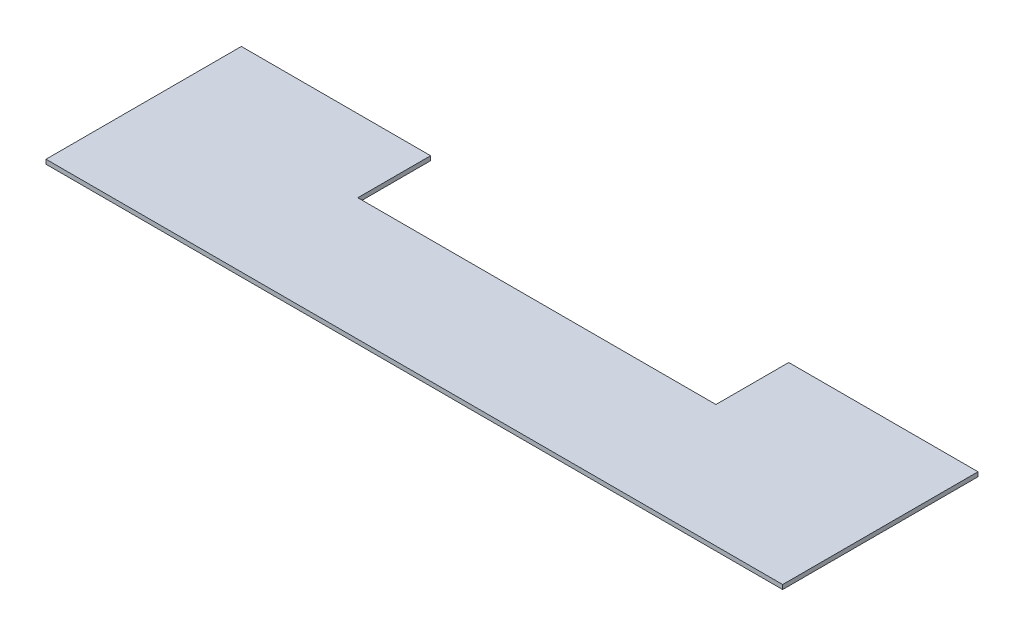
ISO-10303-21;
HEADER;
FILE_DESCRIPTION(('STEP AP214'),'2;1');
FILE_NAME('part.step','',(''),(''),'','','');
FILE_SCHEMA(('AUTOMOTIVE_DESIGN { 1 0 10303 214 1 1 1 1 }'));
ENDSEC;
DATA;
#1=APPLICATION_CONTEXT('core data for automotive mechanical design processes');
#2=APPLICATION_PROTOCOL_DEFINITION('international standard','automotive_design',2000,#1);
#3=PRODUCT_CONTEXT('',#1,'mechanical');
#4=PRODUCT('Part','Part','',(#3));
#5=PRODUCT_RELATED_PRODUCT_CATEGORY('part','',(#4));
#6=PRODUCT_DEFINITION_FORMATION('','',#4);
#7=PRODUCT_DEFINITION_CONTEXT('part definition',#1,'design');
#8=PRODUCT_DEFINITION('design','',#6,#7);
#9=PRODUCT_DEFINITION_SHAPE('','',#8);
#10=(LENGTH_UNIT() NAMED_UNIT(*) SI_UNIT(.MILLI.,.METRE.));
#11=(NAMED_UNIT(*) PLANE_ANGLE_UNIT() SI_UNIT($,.RADIAN.));
#12=(NAMED_UNIT(*) SI_UNIT($,.STERADIAN.) SOLID_ANGLE_UNIT());
#13=UNCERTAINTY_MEASURE_WITH_UNIT(LENGTH_MEASURE(1.E-05),#10,'distance_accuracy_value','');
#14=(GEOMETRIC_REPRESENTATION_CONTEXT(3) GLOBAL_UNCERTAINTY_ASSIGNED_CONTEXT((#13)) GLOBAL_UNIT_ASSIGNED_CONTEXT((#10,
#11,#12)) REPRESENTATION_CONTEXT('',''));
#15=CARTESIAN_POINT('',(0.,0.,0.));
#16=DIRECTION('',(0.,0.,1.));
#17=DIRECTION('',(1.,0.,0.));
#18=AXIS2_PLACEMENT_3D('',#15,#16,#17);
#19=CARTESIAN_POINT('',(-297.333718435658,3.,-57.5535729014638));
#20=DIRECTION('',(1.,0.,0.));
#21=DIRECTION('',(0.,0.,-1.));
#22=AXIS2_PLACEMENT_3D('',#19,#20,#21);
#23=PLANE('',#22);
#24=DIRECTION('',(0.,0.,1.));
#25=VECTOR('',#24,1.);
#26=CARTESIAN_POINT('',(-297.333718435658,0.,-57.5535729014638));
#27=LINE('',#26,#25);
#28=CARTESIAN_POINT('',(-297.333718435658,0.,-57.5535729014638));
#29=VERTEX_POINT('',#28);
#30=CARTESIAN_POINT('',(-297.333718435655,0.,76.6273819960116));
#31=VERTEX_POINT('',#30);
#32=EDGE_CURVE('E129',#29,#31,#27,.T.);
#33=ORIENTED_EDGE('',*,*,#32,.T.);
#34=DIRECTION('',(0.,-1.,0.));
#35=VECTOR('',#34,1.);
#36=CARTESIAN_POINT('',(-297.333718435655,3.,76.6273819960116));
#37=LINE('',#36,#35);
#38=CARTESIAN_POINT('',(-297.333718435655,3.,76.6273819960116));
#39=VERTEX_POINT('',#38);
#40=EDGE_CURVE('E11',#39,#31,#37,.T.);
#41=ORIENTED_EDGE('',*,*,#40,.F.);
#42=DIRECTION('',(0.,0.,1.));
#43=VECTOR('',#42,1.);
#44=CARTESIAN_POINT('',(-297.333718435658,3.,-57.5535729014638));
#45=LINE('',#44,#43);
#46=CARTESIAN_POINT('',(-297.333718435658,3.,-57.5535729014638));
#47=VERTEX_POINT('',#46);
#48=EDGE_CURVE('E144',#47,#39,#45,.T.);
#49=ORIENTED_EDGE('',*,*,#48,.F.);
#50=DIRECTION('',(0.,-1.,0.));
#51=VECTOR('',#50,1.);
#52=CARTESIAN_POINT('',(-297.333718435658,3.,-57.5535729014638));
#53=LINE('',#52,#51);
#54=EDGE_CURVE('E125',#47,#29,#53,.T.);
#55=ORIENTED_EDGE('',*,*,#54,.T.);
#56=EDGE_LOOP('',(#33,#41,#49,#55));
#57=FACE_BOUND('',#56,.T.);
#58=ADVANCED_FACE('F33',(#57),#23,.F.);
#59=CARTESIAN_POINT('',(-297.333718435655,3.,76.6273819960116));
#60=DIRECTION('',(0.,0.,-1.));
#61=DIRECTION('',(-1.,0.,0.));
#62=AXIS2_PLACEMENT_3D('',#59,#60,#61);
#63=PLANE('',#62);
#64=DIRECTION('',(1.,0.,0.));
#65=VECTOR('',#64,1.);
#66=CARTESIAN_POINT('',(-297.333718435655,0.,76.6273819960116));
#67=LINE('',#66,#65);
#68=CARTESIAN_POINT('',(208.66628156406,0.,76.6273819960116));
#69=VERTEX_POINT('',#68);
#70=EDGE_CURVE('E132',#31,#69,#67,.T.);
#71=ORIENTED_EDGE('',*,*,#70,.T.);
#72=DIRECTION('',(0.,-1.,0.));
#73=VECTOR('',#72,1.);
#74=CARTESIAN_POINT('',(208.66628156406,3.,76.6273819960116));
#75=LINE('',#74,#73);
#76=CARTESIAN_POINT('',(208.66628156406,3.,76.6273819960116));
#77=VERTEX_POINT('',#76);
#78=EDGE_CURVE('E41',#77,#69,#75,.T.);
#79=ORIENTED_EDGE('',*,*,#78,.F.);
#80=DIRECTION('',(1.,0.,0.));
#81=VECTOR('',#80,1.);
#82=CARTESIAN_POINT('',(-297.333718435655,3.,76.6273819960116));
#83=LINE('',#82,#81);
#84=EDGE_CURVE('E91',#39,#77,#83,.T.);
#85=ORIENTED_EDGE('',*,*,#84,.F.);
#86=ORIENTED_EDGE('',*,*,#40,.T.);
#87=EDGE_LOOP('',(#71,#79,#85,#86));
#88=FACE_BOUND('',#87,.T.);
#89=ADVANCED_FACE('F178',(#88),#63,.F.);
#90=CARTESIAN_POINT('',(208.66628156406,3.,76.6273819960116));
#91=DIRECTION('',(-1.,0.,0.));
#92=DIRECTION('',(0.,0.,1.));
#93=AXIS2_PLACEMENT_3D('',#90,#91,#92);
#94=PLANE('',#93);
#95=DIRECTION('',(0.,0.,-1.));
#96=VECTOR('',#95,1.);
#97=CARTESIAN_POINT('',(208.66628156406,0.,76.6273819960116));
#98=LINE('',#97,#96);
#99=CARTESIAN_POINT('',(208.66628156406,0.,-57.5535729014638));
#100=VERTEX_POINT('',#99);
#101=EDGE_CURVE('E134',#69,#100,#98,.T.);
#102=ORIENTED_EDGE('',*,*,#101,.T.);
#103=DIRECTION('',(0.,-1.,0.));
#104=VECTOR('',#103,1.);
#105=CARTESIAN_POINT('',(208.66628156406,3.,-57.5535729014638));
#106=LINE('',#105,#104);
#107=CARTESIAN_POINT('',(208.66628156406,3.,-57.5535729014638));
#108=VERTEX_POINT('',#107);
#109=EDGE_CURVE('E151',#108,#100,#106,.T.);
#110=ORIENTED_EDGE('',*,*,#109,.F.);
#111=DIRECTION('',(0.,0.,-1.));
#112=VECTOR('',#111,1.);
#113=CARTESIAN_POINT('',(208.66628156406,3.,76.6273819960116));
#114=LINE('',#113,#112);
#115=EDGE_CURVE('E159',#77,#108,#114,.T.);
#116=ORIENTED_EDGE('',*,*,#115,.F.);
#117=ORIENTED_EDGE('',*,*,#78,.T.);
#118=EDGE_LOOP('',(#102,#110,#116,#117));
#119=FACE_BOUND('',#118,.T.);
#120=ADVANCED_FACE('F157',(#119),#94,.F.);
#121=CARTESIAN_POINT('',(208.66628156406,3.,-57.5535729014638));
#122=DIRECTION('',(0.,0.,1.));
#123=DIRECTION('',(1.,0.,0.));
#124=AXIS2_PLACEMENT_3D('',#121,#122,#123);
#125=PLANE('',#124);
#126=DIRECTION('',(-1.,0.,0.));
#127=VECTOR('',#126,1.);
#128=CARTESIAN_POINT('',(208.66628156406,0.,-57.5535729014638));
#129=LINE('',#128,#127);
#130=CARTESIAN_POINT('',(78.6662815640762,0.,-57.5535729014638));
#131=VERTEX_POINT('',#130);
#132=EDGE_CURVE('E136',#100,#131,#129,.T.);
#133=ORIENTED_EDGE('',*,*,#132,.T.);
#134=DIRECTION('',(0.,-1.,0.));
#135=VECTOR('',#134,1.);
#136=CARTESIAN_POINT('',(78.6662815640762,3.,-57.5535729014638));
#137=LINE('',#136,#135);
#138=CARTESIAN_POINT('',(78.6662815640762,3.,-57.5535729014638));
#139=VERTEX_POINT('',#138);
#140=EDGE_CURVE('E148',#139,#131,#137,.T.);
#141=ORIENTED_EDGE('',*,*,#140,.F.);
#142=DIRECTION('',(-1.,0.,0.));
#143=VECTOR('',#142,1.);
#144=CARTESIAN_POINT('',(208.66628156406,3.,-57.5535729014638));
#145=LINE('',#144,#143);
#146=EDGE_CURVE('E170',#108,#139,#145,.T.);
#147=ORIENTED_EDGE('',*,*,#146,.F.);
#148=ORIENTED_EDGE('',*,*,#109,.T.);
#149=EDGE_LOOP('',(#133,#141,#147,#148));
#150=FACE_BOUND('',#149,.T.);
#151=ADVANCED_FACE('F166',(#150),#125,.F.);
#152=CARTESIAN_POINT('',(78.6662815640762,3.,-7.55357290146381));
#153=DIRECTION('',(1.,0.,0.));
#154=DIRECTION('',(0.,0.,-1.));
#155=AXIS2_PLACEMENT_3D('',#152,#153,#154);
#156=PLANE('',#155);
#157=DIRECTION('',(0.,0.,1.));
#158=VECTOR('',#157,1.);
#159=CARTESIAN_POINT('',(78.6662815640762,0.,-7.55357290146381));
#160=LINE('',#159,#158);
#161=CARTESIAN_POINT('',(78.6662815640762,0.,-7.55357290146381));
#162=VERTEX_POINT('',#161);
#163=EDGE_CURVE('E139',#131,#162,#160,.T.);
#164=ORIENTED_EDGE('',*,*,#163,.T.);
#165=DIRECTION('',(0.,-1.,0.));
#166=VECTOR('',#165,1.);
#167=CARTESIAN_POINT('',(78.6662815640762,3.,-7.55357290146381));
#168=LINE('',#167,#166);
#169=CARTESIAN_POINT('',(78.6662815640762,3.,-7.55357290146381));
#170=VERTEX_POINT('',#169);
#171=EDGE_CURVE('E120',#170,#162,#168,.T.);
#172=ORIENTED_EDGE('',*,*,#171,.F.);
#173=DIRECTION('',(0.,0.,1.));
#174=VECTOR('',#173,1.);
#175=CARTESIAN_POINT('',(78.6662815640762,3.,-57.5535729014638));
#176=LINE('',#175,#174);
#177=EDGE_CURVE('E110',#139,#170,#176,.T.);
#178=ORIENTED_EDGE('',*,*,#177,.F.);
#179=ORIENTED_EDGE('',*,*,#140,.T.);
#180=EDGE_LOOP('',(#164,#172,#178,#179));
#181=FACE_BOUND('',#180,.T.);
#182=ADVANCED_FACE('F169',(#181),#156,.F.);
#183=CARTESIAN_POINT('',(-167.333718435646,3.,-7.55357290146381));
#184=DIRECTION('',(0.,0.,1.));
#185=DIRECTION('',(1.,0.,0.));
#186=AXIS2_PLACEMENT_3D('',#183,#184,#185);
#187=PLANE('',#186);
#188=DIRECTION('',(-1.,0.,0.));
#189=VECTOR('',#188,1.);
#190=CARTESIAN_POINT('',(-167.333718435646,0.,-7.55357290146381));
#191=LINE('',#190,#189);
#192=CARTESIAN_POINT('',(-167.333718435646,0.,-7.55357290146381));
#193=VERTEX_POINT('',#192);
#194=EDGE_CURVE('E119',#162,#193,#191,.T.);
#195=ORIENTED_EDGE('',*,*,#194,.T.);
#196=DIRECTION('',(0.,-1.,0.));
#197=VECTOR('',#196,1.);
#198=CARTESIAN_POINT('',(-167.333718435646,3.,-7.55357290146381));
#199=LINE('',#198,#197);
#200=CARTESIAN_POINT('',(-167.333718435646,3.,-7.55357290146381));
#201=VERTEX_POINT('',#200);
#202=EDGE_CURVE('E116',#201,#193,#199,.T.);
#203=ORIENTED_EDGE('',*,*,#202,.F.);
#204=DIRECTION('',(-1.,0.,0.));
#205=VECTOR('',#204,1.);
#206=CARTESIAN_POINT('',(-167.333718435646,3.,-7.55357290146381));
#207=LINE('',#206,#205);
#208=EDGE_CURVE('E104',#170,#201,#207,.T.);
#209=ORIENTED_EDGE('',*,*,#208,.F.);
#210=ORIENTED_EDGE('',*,*,#171,.T.);
#211=EDGE_LOOP('',(#195,#203,#209,#210));
#212=FACE_BOUND('',#211,.T.);
#213=ADVANCED_FACE('F117',(#212),#187,.F.);
#214=CARTESIAN_POINT('',(-167.333718435646,3.,-57.5535729014638));
#215=DIRECTION('',(-1.,0.,0.));
#216=DIRECTION('',(0.,0.,1.));
#217=AXIS2_PLACEMENT_3D('',#214,#215,#216);
#218=PLANE('',#217);
#219=DIRECTION('',(0.,0.,-1.));
#220=VECTOR('',#219,1.);
#221=CARTESIAN_POINT('',(-167.333718435646,0.,-57.5535729014638));
#222=LINE('',#221,#220);
#223=CARTESIAN_POINT('',(-167.333718435646,0.,-57.5535729014638));
#224=VERTEX_POINT('',#223);
#225=EDGE_CURVE('E77',#193,#224,#222,.T.);
#226=ORIENTED_EDGE('',*,*,#225,.T.);
#227=DIRECTION('',(0.,-1.,0.));
#228=VECTOR('',#227,1.);
#229=CARTESIAN_POINT('',(-167.333718435646,3.,-57.5535729014638));
#230=LINE('',#229,#228);
#231=CARTESIAN_POINT('',(-167.333718435646,3.,-57.5535729014638));
#232=VERTEX_POINT('',#231);
#233=EDGE_CURVE('E121',#232,#224,#230,.T.);
#234=ORIENTED_EDGE('',*,*,#233,.F.);
#235=DIRECTION('',(0.,0.,-1.));
#236=VECTOR('',#235,1.);
#237=CARTESIAN_POINT('',(-167.333718435646,3.,-17.5535729014638));
#238=LINE('',#237,#236);
#239=EDGE_CURVE('E108',#201,#232,#238,.T.);
#240=ORIENTED_EDGE('',*,*,#239,.F.);
#241=ORIENTED_EDGE('',*,*,#202,.T.);
#242=EDGE_LOOP('',(#226,#234,#240,#241));
#243=FACE_BOUND('',#242,.T.);
#244=ADVANCED_FACE('F123',(#243),#218,.F.);
#245=CARTESIAN_POINT('',(-297.333718435658,3.,-57.5535729014638));
#246=DIRECTION('',(0.,0.,1.));
#247=DIRECTION('',(1.,0.,0.));
#248=AXIS2_PLACEMENT_3D('',#245,#246,#247);
#249=PLANE('',#248);
#250=DIRECTION('',(-1.,0.,0.));
#251=VECTOR('',#250,1.);
#252=CARTESIAN_POINT('',(-297.333718435658,0.,-57.5535729014638));
#253=LINE('',#252,#251);
#254=EDGE_CURVE('E83',#224,#29,#253,.T.);
#255=ORIENTED_EDGE('',*,*,#254,.T.);
#256=ORIENTED_EDGE('',*,*,#54,.F.);
#257=DIRECTION('',(-1.,0.,0.));
#258=VECTOR('',#257,1.);
#259=CARTESIAN_POINT('',(-297.333718435658,3.,-57.5535729014638));
#260=LINE('',#259,#258);
#261=EDGE_CURVE('E49',#232,#47,#260,.T.);
#262=ORIENTED_EDGE('',*,*,#261,.F.);
#263=ORIENTED_EDGE('',*,*,#233,.T.);
#264=EDGE_LOOP('',(#255,#256,#262,#263));
#265=FACE_BOUND('',#264,.T.);
#266=ADVANCED_FACE('F194',(#265),#249,.F.);
#267=CARTESIAN_POINT('',(0.,3.,0.));
#268=DIRECTION('',(0.,1.,0.));
#269=DIRECTION('',(0.,0.,1.));
#270=AXIS2_PLACEMENT_3D('',#267,#268,#269);
#271=PLANE('',#270);
#272=ORIENTED_EDGE('',*,*,#48,.T.);
#273=ORIENTED_EDGE('',*,*,#84,.T.);
#274=ORIENTED_EDGE('',*,*,#115,.T.);
#275=ORIENTED_EDGE('',*,*,#146,.T.);
#276=ORIENTED_EDGE('',*,*,#177,.T.);
#277=ORIENTED_EDGE('',*,*,#208,.T.);
#278=ORIENTED_EDGE('',*,*,#239,.T.);
#279=ORIENTED_EDGE('',*,*,#261,.T.);
#280=EDGE_LOOP('',(#272,#273,#274,#275,#276,#277,#278,#279));
#281=FACE_BOUND('',#280,.T.);
#282=ADVANCED_FACE('F106',(#281),#271,.T.);
#283=CARTESIAN_POINT('',(0.,0.,0.));
#284=DIRECTION('',(0.,1.,0.));
#285=DIRECTION('',(0.,0.,1.));
#286=AXIS2_PLACEMENT_3D('',#283,#284,#285);
#287=PLANE('',#286);
#288=ORIENTED_EDGE('',*,*,#32,.F.);
#289=ORIENTED_EDGE('',*,*,#254,.F.);
#290=ORIENTED_EDGE('',*,*,#225,.F.);
#291=ORIENTED_EDGE('',*,*,#194,.F.);
#292=ORIENTED_EDGE('',*,*,#163,.F.);
#293=ORIENTED_EDGE('',*,*,#132,.F.);
#294=ORIENTED_EDGE('',*,*,#101,.F.);
#295=ORIENTED_EDGE('',*,*,#70,.F.);
#296=EDGE_LOOP('',(#288,#289,#290,#291,#292,#293,#294,#295));
#297=FACE_BOUND('',#296,.T.);
#298=ADVANCED_FACE('F163',(#297),#287,.F.);
#299=CLOSED_SHELL('',(#58,#89,#120,#151,#182,#213,#244,#266,#282,#298));
#300=MANIFOLD_SOLID_BREP('B2',#299);
#301=ADVANCED_BREP_SHAPE_REPRESENTATION('',(#18,#300),#14);
#302=SHAPE_DEFINITION_REPRESENTATION(#9,#301);
ENDSEC;
END-ISO-10303-21;
